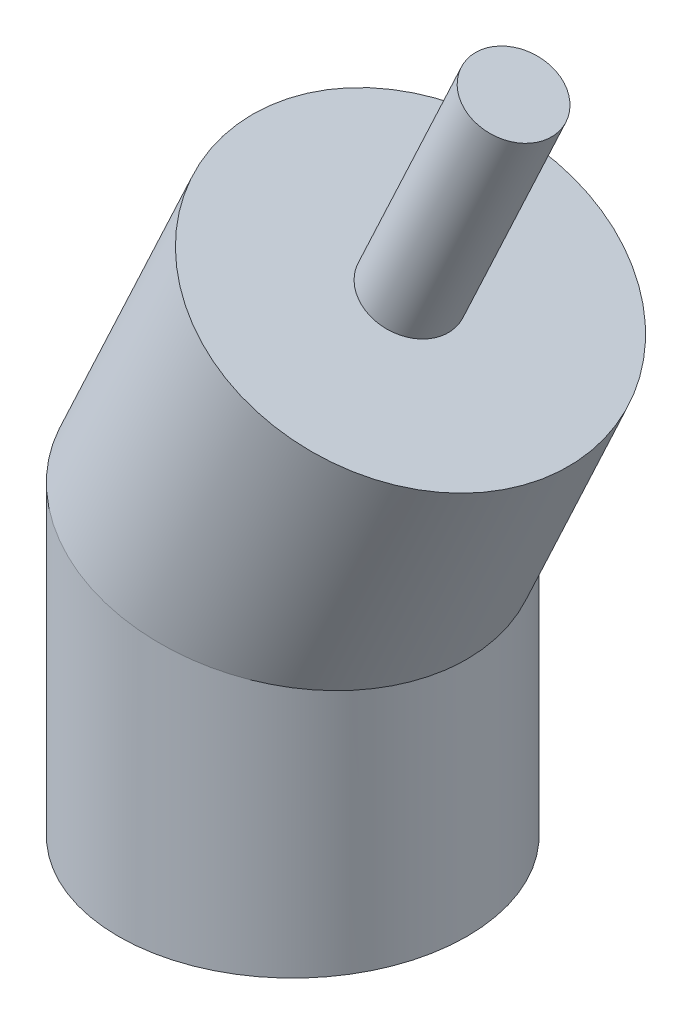
ISO-10303-21;
HEADER;
FILE_DESCRIPTION(('STEP AP214'),'2;1');
FILE_NAME('part.step','',(''),(''),'','','');
FILE_SCHEMA(('AUTOMOTIVE_DESIGN { 1 0 10303 214 1 1 1 1 }'));
ENDSEC;
DATA;
#1=APPLICATION_CONTEXT('core data for automotive mechanical design processes');
#2=APPLICATION_PROTOCOL_DEFINITION('international standard','automotive_design',2000,#1);
#3=PRODUCT_CONTEXT('',#1,'mechanical');
#4=PRODUCT('Part','Part','',(#3));
#5=PRODUCT_RELATED_PRODUCT_CATEGORY('part','',(#4));
#6=PRODUCT_DEFINITION_FORMATION('','',#4);
#7=PRODUCT_DEFINITION_CONTEXT('part definition',#1,'design');
#8=PRODUCT_DEFINITION('design','',#6,#7);
#9=PRODUCT_DEFINITION_SHAPE('','',#8);
#10=(LENGTH_UNIT() NAMED_UNIT(*) SI_UNIT(.MILLI.,.METRE.));
#11=(NAMED_UNIT(*) PLANE_ANGLE_UNIT() SI_UNIT($,.RADIAN.));
#12=(NAMED_UNIT(*) SI_UNIT($,.STERADIAN.) SOLID_ANGLE_UNIT());
#13=UNCERTAINTY_MEASURE_WITH_UNIT(LENGTH_MEASURE(1.E-05),#10,'distance_accuracy_value','');
#14=(GEOMETRIC_REPRESENTATION_CONTEXT(3) GLOBAL_UNCERTAINTY_ASSIGNED_CONTEXT((#13)) GLOBAL_UNIT_ASSIGNED_CONTEXT((#10,
#11,#12)) REPRESENTATION_CONTEXT('',''));
#15=CARTESIAN_POINT('',(0.,0.,0.));
#16=DIRECTION('',(0.,0.,1.));
#17=DIRECTION('',(1.,0.,0.));
#18=AXIS2_PLACEMENT_3D('',#15,#16,#17);
#19=CARTESIAN_POINT('',(0.,40.,0.));
#20=DIRECTION('',(0.4226182617407,0.90630778703665,0.));
#21=DIRECTION('',(-0.90630778703665,0.4226182617407,0.));
#22=AXIS2_PLACEMENT_3D('',#19,#20,#21);
#23=CYLINDRICAL_SURFACE('',#22,25.);
#24=CARTESIAN_POINT('',(0.,40.,0.));
#25=DIRECTION('',(0.216439613938103,0.976296007119933,0.));
#26=DIRECTION('',(0.976296007119933,-0.216439613938103,0.));
#27=AXIS2_PLACEMENT_3D('',#24,#25,#26);
#28=ELLIPSE('',#27,25.6069878578627,25.);
#29=CARTESIAN_POINT('',(25.,34.4576334339265,0.));
#30=VERTEX_POINT('',#29);
#31=EDGE_CURVE('E40',#30,#30,#28,.T.);
#32=ORIENTED_EDGE('',*,*,#31,.T.);
#33=EDGE_LOOP('',(#32));
#34=FACE_BOUND('',#33,.T.);
#35=CARTESIAN_POINT('',(16.904730469628,76.252311481466,0.));
#36=DIRECTION('',(0.4226182617407,0.90630778703665,0.));
#37=DIRECTION('',(-0.90630778703665,0.4226182617407,0.));
#38=AXIS2_PLACEMENT_3D('',#35,#36,#37);
#39=CIRCLE('',#38,25.);
#40=CARTESIAN_POINT('',(-5.75296420628826,86.8177680249835,0.));
#41=VERTEX_POINT('',#40);
#42=EDGE_CURVE('E11',#41,#41,#39,.F.);
#43=ORIENTED_EDGE('',*,*,#42,.T.);
#44=EDGE_LOOP('',(#43));
#45=FACE_BOUND('',#44,.T.);
#46=ADVANCED_FACE('F34',(#34,#45),#23,.T.);
#47=CARTESIAN_POINT('',(0.,110.710678118655,0.));
#48=DIRECTION('',(0.,-1.,0.));
#49=DIRECTION('',(1.,0.,0.));
#50=AXIS2_PLACEMENT_3D('',#47,#48,#49);
#51=CYLINDRICAL_SURFACE('',#50,25.);
#52=CARTESIAN_POINT('',(0.,0.,0.));
#53=DIRECTION('',(0.,1.,0.));
#54=DIRECTION('',(0.,0.,1.));
#55=AXIS2_PLACEMENT_3D('',#52,#53,#54);
#56=CIRCLE('',#55,25.);
#57=CARTESIAN_POINT('',(0.,0.,25.));
#58=VERTEX_POINT('',#57);
#59=EDGE_CURVE('E44',#58,#58,#56,.T.);
#60=ORIENTED_EDGE('',*,*,#59,.T.);
#61=EDGE_LOOP('',(#60));
#62=FACE_BOUND('',#61,.T.);
#63=ORIENTED_EDGE('',*,*,#31,.F.);
#64=EDGE_LOOP('',(#63));
#65=FACE_BOUND('',#64,.T.);
#66=ADVANCED_FACE('F76',(#62,#65),#51,.T.);
#67=CARTESIAN_POINT('',(0.,0.,0.));
#68=DIRECTION('',(0.,1.,0.));
#69=DIRECTION('',(0.,0.,1.));
#70=AXIS2_PLACEMENT_3D('',#67,#68,#69);
#71=PLANE('',#70);
#72=CARTESIAN_POINT('',(0.,0.,0.));
#73=DIRECTION('',(0.,-1.,0.));
#74=DIRECTION('',(0.,0.,-1.));
#75=AXIS2_PLACEMENT_3D('',#72,#73,#74);
#76=CIRCLE('',#75,6.);
#77=CARTESIAN_POINT('',(0.,0.,-6.));
#78=VERTEX_POINT('',#77);
#79=EDGE_CURVE('E57',#78,#78,#76,.T.);
#80=ORIENTED_EDGE('',*,*,#79,.F.);
#81=EDGE_LOOP('',(#80));
#82=FACE_BOUND('',#81,.T.);
#83=ORIENTED_EDGE('',*,*,#59,.F.);
#84=EDGE_LOOP('',(#83));
#85=FACE_BOUND('',#84,.T.);
#86=ADVANCED_FACE('F72',(#82,#85),#71,.F.);
#87=CARTESIAN_POINT('',(16.904730469628,76.252311481466,0.));
#88=DIRECTION('',(0.4226182617407,0.90630778703665,0.));
#89=DIRECTION('',(-0.90630778703665,0.4226182617407,0.));
#90=AXIS2_PLACEMENT_3D('',#87,#88,#89);
#91=PLANE('',#90);
#92=CARTESIAN_POINT('',(16.904730469628,76.252311481466,0.));
#93=DIRECTION('',(0.4226182617407,0.90630778703665,0.));
#94=DIRECTION('',(-0.90630778703665,0.4226182617407,0.));
#95=AXIS2_PLACEMENT_3D('',#92,#93,#94);
#96=CIRCLE('',#95,6.00000000000001);
#97=CARTESIAN_POINT('',(11.4668837474081,78.7880210519102,0.));
#98=VERTEX_POINT('',#97);
#99=EDGE_CURVE('E51',#98,#98,#96,.T.);
#100=ORIENTED_EDGE('',*,*,#99,.F.);
#101=EDGE_LOOP('',(#100));
#102=FACE_BOUND('',#101,.T.);
#103=ORIENTED_EDGE('',*,*,#42,.F.);
#104=EDGE_LOOP('',(#103));
#105=FACE_BOUND('',#104,.T.);
#106=ADVANCED_FACE('F75',(#102,#105),#91,.T.);
#107=CARTESIAN_POINT('',(31.6963696305525,107.973084027749,0.));
#108=DIRECTION('',(-0.4226182617407,-0.90630778703665,0.));
#109=DIRECTION('',(0.90630778703665,-0.4226182617407,0.));
#110=AXIS2_PLACEMENT_3D('',#107,#108,#109);
#111=CYLINDRICAL_SURFACE('',#110,6.00000000000001);
#112=CARTESIAN_POINT('',(31.6963696305525,107.973084027749,0.));
#113=DIRECTION('',(0.4226182617407,0.90630778703665,0.));
#114=DIRECTION('',(-0.90630778703665,0.4226182617407,0.));
#115=AXIS2_PLACEMENT_3D('',#112,#113,#114);
#116=CIRCLE('',#115,6.00000000000001);
#117=CARTESIAN_POINT('',(26.2585229083326,110.508793598193,0.));
#118=VERTEX_POINT('',#117);
#119=EDGE_CURVE('E48',#118,#118,#116,.T.);
#120=ORIENTED_EDGE('',*,*,#119,.F.);
#121=EDGE_LOOP('',(#120));
#122=FACE_BOUND('',#121,.T.);
#123=ORIENTED_EDGE('',*,*,#99,.T.);
#124=EDGE_LOOP('',(#123));
#125=FACE_BOUND('',#124,.T.);
#126=ADVANCED_FACE('F88',(#122,#125),#111,.T.);
#127=CARTESIAN_POINT('',(31.6963696305525,107.973084027749,0.));
#128=DIRECTION('',(0.4226182617407,0.90630778703665,0.));
#129=DIRECTION('',(-0.90630778703665,0.4226182617407,0.));
#130=AXIS2_PLACEMENT_3D('',#127,#128,#129);
#131=PLANE('',#130);
#132=ORIENTED_EDGE('',*,*,#119,.T.);
#133=EDGE_LOOP('',(#132));
#134=FACE_BOUND('',#133,.T.);
#135=ADVANCED_FACE('F68',(#134),#131,.T.);
#136=CARTESIAN_POINT('',(0.,20.,0.));
#137=DIRECTION('',(0.,-1.,0.));
#138=DIRECTION('',(0.,0.,-1.));
#139=AXIS2_PLACEMENT_3D('',#136,#137,#138);
#140=CYLINDRICAL_SURFACE('',#139,6.);
#141=CARTESIAN_POINT('',(0.,20.,0.));
#142=DIRECTION('',(0.,-1.,0.));
#143=DIRECTION('',(0.,0.,-1.));
#144=AXIS2_PLACEMENT_3D('',#141,#142,#143);
#145=CIRCLE('',#144,6.);
#146=CARTESIAN_POINT('',(0.,20.,-6.));
#147=VERTEX_POINT('',#146);
#148=EDGE_CURVE('E54',#147,#147,#145,.T.);
#149=ORIENTED_EDGE('',*,*,#148,.F.);
#150=EDGE_LOOP('',(#149));
#151=FACE_BOUND('',#150,.T.);
#152=ORIENTED_EDGE('',*,*,#79,.T.);
#153=EDGE_LOOP('',(#152));
#154=FACE_BOUND('',#153,.T.);
#155=ADVANCED_FACE('F65',(#151,#154),#140,.F.);
#156=CARTESIAN_POINT('',(0.,20.,0.));
#157=DIRECTION('',(0.,-1.,0.));
#158=DIRECTION('',(0.,0.,-1.));
#159=AXIS2_PLACEMENT_3D('',#156,#157,#158);
#160=PLANE('',#159);
#161=ORIENTED_EDGE('',*,*,#148,.T.);
#162=EDGE_LOOP('',(#161));
#163=FACE_BOUND('',#162,.T.);
#164=ADVANCED_FACE('F63',(#163),#160,.T.);
#165=CLOSED_SHELL('',(#46,#66,#86,#106,#126,#135,#155,#164));
#166=MANIFOLD_SOLID_BREP('B2',#165);
#167=ADVANCED_BREP_SHAPE_REPRESENTATION('',(#18,#166),#14);
#168=SHAPE_DEFINITION_REPRESENTATION(#9,#167);
ENDSEC;
END-ISO-10303-21;
